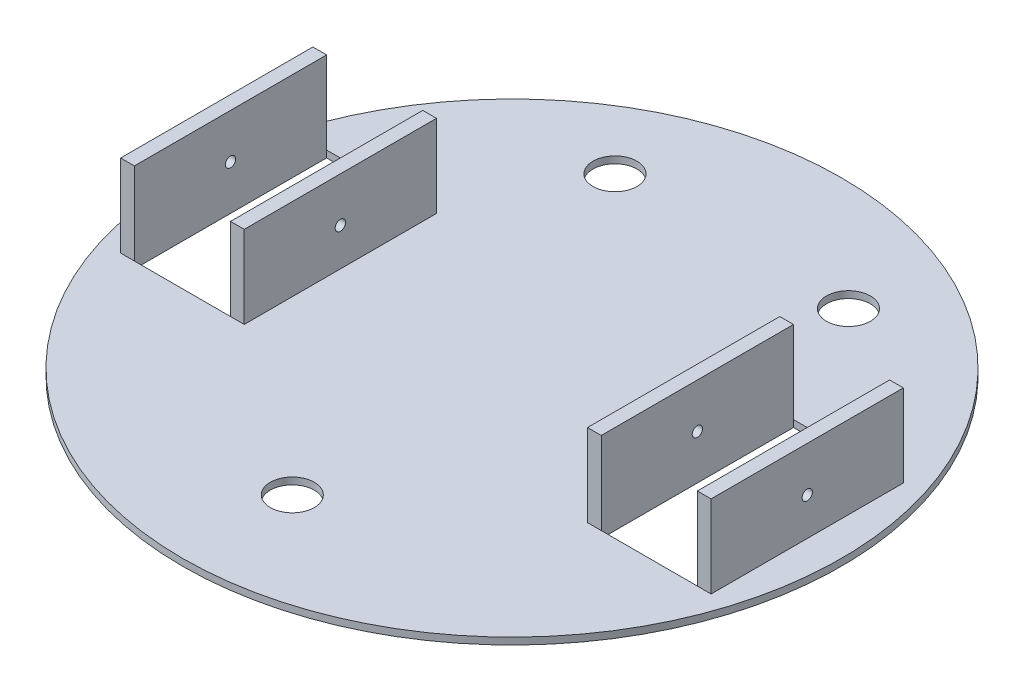
ISO-10303-21;
HEADER;
FILE_DESCRIPTION(('STEP AP214'),'2;1');
FILE_NAME('part.step','',(''),(''),'','','');
FILE_SCHEMA(('AUTOMOTIVE_DESIGN { 1 0 10303 214 1 1 1 1 }'));
ENDSEC;
DATA;
#1=APPLICATION_CONTEXT('core data for automotive mechanical design processes');
#2=APPLICATION_PROTOCOL_DEFINITION('international standard','automotive_design',2000,#1);
#3=PRODUCT_CONTEXT('',#1,'mechanical');
#4=PRODUCT('Part','Part','',(#3));
#5=PRODUCT_RELATED_PRODUCT_CATEGORY('part','',(#4));
#6=PRODUCT_DEFINITION_FORMATION('','',#4);
#7=PRODUCT_DEFINITION_CONTEXT('part definition',#1,'design');
#8=PRODUCT_DEFINITION('design','',#6,#7);
#9=PRODUCT_DEFINITION_SHAPE('','',#8);
#10=(LENGTH_UNIT() NAMED_UNIT(*) SI_UNIT(.MILLI.,.METRE.));
#11=(NAMED_UNIT(*) PLANE_ANGLE_UNIT() SI_UNIT($,.RADIAN.));
#12=(NAMED_UNIT(*) SI_UNIT($,.STERADIAN.) SOLID_ANGLE_UNIT());
#13=UNCERTAINTY_MEASURE_WITH_UNIT(LENGTH_MEASURE(1.E-05),#10,'distance_accuracy_value','');
#14=(GEOMETRIC_REPRESENTATION_CONTEXT(3) GLOBAL_UNCERTAINTY_ASSIGNED_CONTEXT((#13)) GLOBAL_UNIT_ASSIGNED_CONTEXT((#10,
#11,#12)) REPRESENTATION_CONTEXT('',''));
#15=CARTESIAN_POINT('',(0.,0.,0.));
#16=DIRECTION('',(0.,0.,1.));
#17=DIRECTION('',(1.,0.,0.));
#18=AXIS2_PLACEMENT_3D('',#15,#16,#17);
#19=CARTESIAN_POINT('',(0.,3.175,0.));
#20=DIRECTION('',(0.,1.,0.));
#21=DIRECTION('',(0.,0.,1.));
#22=AXIS2_PLACEMENT_3D('',#19,#20,#21);
#23=PLANE('',#22);
#24=CARTESIAN_POINT('',(53.975,3.175,-101.6));
#25=DIRECTION('',(0.,1.,0.));
#26=DIRECTION('',(0.,0.,1.));
#27=AXIS2_PLACEMENT_3D('',#24,#25,#26);
#28=CIRCLE('',#27,10.16);
#29=CARTESIAN_POINT('',(53.975,3.175,-91.44));
#30=VERTEX_POINT('',#29);
#31=EDGE_CURVE('E501',#30,#30,#28,.T.);
#32=ORIENTED_EDGE('',*,*,#31,.F.);
#33=EDGE_LOOP('',(#32));
#34=FACE_BOUND('',#33,.T.);
#35=CARTESIAN_POINT('',(-53.975,3.175,-101.6));
#36=DIRECTION('',(0.,1.,0.));
#37=DIRECTION('',(0.,0.,1.));
#38=AXIS2_PLACEMENT_3D('',#35,#36,#37);
#39=CIRCLE('',#38,10.16);
#40=CARTESIAN_POINT('',(-53.975,3.175,-91.44));
#41=VERTEX_POINT('',#40);
#42=EDGE_CURVE('E503',#41,#41,#39,.T.);
#43=ORIENTED_EDGE('',*,*,#42,.F.);
#44=EDGE_LOOP('',(#43));
#45=FACE_BOUND('',#44,.T.);
#46=CARTESIAN_POINT('',(0.,3.175,101.6));
#47=DIRECTION('',(0.,1.,0.));
#48=DIRECTION('',(0.,0.,1.));
#49=AXIS2_PLACEMENT_3D('',#46,#47,#48);
#50=CIRCLE('',#49,10.16);
#51=CARTESIAN_POINT('',(0.,3.175,111.76));
#52=VERTEX_POINT('',#51);
#53=EDGE_CURVE('E509',#52,#52,#50,.T.);
#54=ORIENTED_EDGE('',*,*,#53,.F.);
#55=EDGE_LOOP('',(#54));
#56=FACE_BOUND('',#55,.T.);
#57=DIRECTION('',(1.,0.,0.));
#58=VECTOR('',#57,1.);
#59=CARTESIAN_POINT('',(85.725,3.175,-44.45));
#60=LINE('',#59,#58);
#61=CARTESIAN_POINT('',(79.375,3.175,-44.45));
#62=VERTEX_POINT('',#61);
#63=CARTESIAN_POINT('',(85.725,3.175,-44.45));
#64=VERTEX_POINT('',#63);
#65=EDGE_CURVE('E205',#62,#64,#60,.T.);
#66=ORIENTED_EDGE('',*,*,#65,.T.);
#67=DIRECTION('',(1.,0.,0.));
#68=VECTOR('',#67,1.);
#69=CARTESIAN_POINT('',(85.725,3.175,-44.45));
#70=LINE('',#69,#68);
#71=CARTESIAN_POINT('',(130.175,3.175,-44.45));
#72=VERTEX_POINT('',#71);
#73=EDGE_CURVE('E248',#64,#72,#70,.T.);
#74=ORIENTED_EDGE('',*,*,#73,.T.);
#75=DIRECTION('',(1.,0.,0.));
#76=VECTOR('',#75,1.);
#77=CARTESIAN_POINT('',(130.175,3.175,-44.45));
#78=LINE('',#77,#76);
#79=CARTESIAN_POINT('',(136.525,3.175,-44.45));
#80=VERTEX_POINT('',#79);
#81=EDGE_CURVE('E218',#72,#80,#78,.T.);
#82=ORIENTED_EDGE('',*,*,#81,.T.);
#83=DIRECTION('',(0.,0.,1.));
#84=VECTOR('',#83,1.);
#85=CARTESIAN_POINT('',(136.525,3.175,-44.45));
#86=LINE('',#85,#84);
#87=CARTESIAN_POINT('',(136.525,3.175,44.45));
#88=VERTEX_POINT('',#87);
#89=EDGE_CURVE('E230',#80,#88,#86,.T.);
#90=ORIENTED_EDGE('',*,*,#89,.T.);
#91=DIRECTION('',(-1.,0.,0.));
#92=VECTOR('',#91,1.);
#93=CARTESIAN_POINT('',(130.175,3.175,44.45));
#94=LINE('',#93,#92);
#95=CARTESIAN_POINT('',(130.175,3.175,44.45));
#96=VERTEX_POINT('',#95);
#97=EDGE_CURVE('E185',#88,#96,#94,.T.);
#98=ORIENTED_EDGE('',*,*,#97,.T.);
#99=DIRECTION('',(-1.,0.,0.));
#100=VECTOR('',#99,1.);
#101=CARTESIAN_POINT('',(85.725,3.175,44.45));
#102=LINE('',#101,#100);
#103=CARTESIAN_POINT('',(85.725,3.175,44.45));
#104=VERTEX_POINT('',#103);
#105=EDGE_CURVE('E244',#96,#104,#102,.T.);
#106=ORIENTED_EDGE('',*,*,#105,.T.);
#107=DIRECTION('',(-1.,0.,0.));
#108=VECTOR('',#107,1.);
#109=CARTESIAN_POINT('',(85.725,3.175,44.45));
#110=LINE('',#109,#108);
#111=CARTESIAN_POINT('',(79.375,3.175,44.45));
#112=VERTEX_POINT('',#111);
#113=EDGE_CURVE('E55',#104,#112,#110,.T.);
#114=ORIENTED_EDGE('',*,*,#113,.T.);
#115=DIRECTION('',(0.,0.,-1.));
#116=VECTOR('',#115,1.);
#117=CARTESIAN_POINT('',(79.375,3.175,-44.45));
#118=LINE('',#117,#116);
#119=EDGE_CURVE('E50',#112,#62,#118,.T.);
#120=ORIENTED_EDGE('',*,*,#119,.T.);
#121=EDGE_LOOP('',(#66,#74,#82,#90,#98,#106,#114,#120));
#122=FACE_BOUND('',#121,.T.);
#123=DIRECTION('',(0.,0.,-1.));
#124=VECTOR('',#123,1.);
#125=CARTESIAN_POINT('',(-79.375,3.175,-44.45));
#126=LINE('',#125,#124);
#127=CARTESIAN_POINT('',(-79.375,3.175,44.45));
#128=VERTEX_POINT('',#127);
#129=CARTESIAN_POINT('',(-79.375,3.175,-44.45));
#130=VERTEX_POINT('',#129);
#131=EDGE_CURVE('E279',#128,#130,#126,.T.);
#132=ORIENTED_EDGE('',*,*,#131,.F.);
#133=DIRECTION('',(1.,0.,0.));
#134=VECTOR('',#133,1.);
#135=CARTESIAN_POINT('',(-85.725,3.175,44.45));
#136=LINE('',#135,#134);
#137=CARTESIAN_POINT('',(-85.725,3.175,44.45));
#138=VERTEX_POINT('',#137);
#139=EDGE_CURVE('E260',#138,#128,#136,.T.);
#140=ORIENTED_EDGE('',*,*,#139,.F.);
#141=DIRECTION('',(1.,0.,0.));
#142=VECTOR('',#141,1.);
#143=CARTESIAN_POINT('',(-85.725,3.175,44.45));
#144=LINE('',#143,#142);
#145=CARTESIAN_POINT('',(-130.175,3.175,44.45));
#146=VERTEX_POINT('',#145);
#147=EDGE_CURVE('E327',#146,#138,#144,.T.);
#148=ORIENTED_EDGE('',*,*,#147,.F.);
#149=DIRECTION('',(1.,0.,0.));
#150=VECTOR('',#149,1.);
#151=CARTESIAN_POINT('',(-130.175,3.175,44.45));
#152=LINE('',#151,#150);
#153=CARTESIAN_POINT('',(-136.525,3.175,44.45));
#154=VERTEX_POINT('',#153);
#155=EDGE_CURVE('E297',#154,#146,#152,.T.);
#156=ORIENTED_EDGE('',*,*,#155,.F.);
#157=DIRECTION('',(0.,0.,1.));
#158=VECTOR('',#157,1.);
#159=CARTESIAN_POINT('',(-136.525,3.175,-44.45));
#160=LINE('',#159,#158);
#161=CARTESIAN_POINT('',(-136.525,3.175,-44.45));
#162=VERTEX_POINT('',#161);
#163=EDGE_CURVE('E306',#162,#154,#160,.T.);
#164=ORIENTED_EDGE('',*,*,#163,.F.);
#165=DIRECTION('',(-1.,0.,0.));
#166=VECTOR('',#165,1.);
#167=CARTESIAN_POINT('',(-130.175,3.175,-44.45));
#168=LINE('',#167,#166);
#169=CARTESIAN_POINT('',(-130.175,3.175,-44.45));
#170=VERTEX_POINT('',#169);
#171=EDGE_CURVE('E292',#170,#162,#168,.T.);
#172=ORIENTED_EDGE('',*,*,#171,.F.);
#173=DIRECTION('',(-1.,0.,0.));
#174=VECTOR('',#173,1.);
#175=CARTESIAN_POINT('',(-85.725,3.175,-44.45));
#176=LINE('',#175,#174);
#177=CARTESIAN_POINT('',(-85.725,3.175,-44.45));
#178=VERTEX_POINT('',#177);
#179=EDGE_CURVE('E322',#178,#170,#176,.T.);
#180=ORIENTED_EDGE('',*,*,#179,.F.);
#181=DIRECTION('',(-1.,0.,0.));
#182=VECTOR('',#181,1.);
#183=CARTESIAN_POINT('',(-85.725,3.175,-44.45));
#184=LINE('',#183,#182);
#185=EDGE_CURVE('E271',#130,#178,#184,.T.);
#186=ORIENTED_EDGE('',*,*,#185,.F.);
#187=EDGE_LOOP('',(#132,#140,#148,#156,#164,#172,#180,#186));
#188=FACE_BOUND('',#187,.T.);
#189=CARTESIAN_POINT('',(0.,3.175,0.));
#190=DIRECTION('',(0.,1.,0.));
#191=DIRECTION('',(0.,0.,1.));
#192=AXIS2_PLACEMENT_3D('',#189,#190,#191);
#193=CIRCLE('',#192,152.4);
#194=CARTESIAN_POINT('',(0.,3.175,152.4));
#195=VERTEX_POINT('',#194);
#196=EDGE_CURVE('E11',#195,#195,#193,.T.);
#197=ORIENTED_EDGE('',*,*,#196,.T.);
#198=EDGE_LOOP('',(#197));
#199=FACE_BOUND('',#198,.T.);
#200=ADVANCED_FACE('F33',(#34,#45,#56,#122,#188,#199),#23,.T.);
#201=CARTESIAN_POINT('',(0.,0.,0.));
#202=DIRECTION('',(0.,1.,0.));
#203=DIRECTION('',(0.,0.,1.));
#204=AXIS2_PLACEMENT_3D('',#201,#202,#203);
#205=PLANE('',#204);
#206=CARTESIAN_POINT('',(53.975,0.,-101.6));
#207=DIRECTION('',(0.,1.,0.));
#208=DIRECTION('',(0.,0.,1.));
#209=AXIS2_PLACEMENT_3D('',#206,#207,#208);
#210=CIRCLE('',#209,10.16);
#211=CARTESIAN_POINT('',(53.975,0.,-91.44));
#212=VERTEX_POINT('',#211);
#213=EDGE_CURVE('E498',#212,#212,#210,.T.);
#214=ORIENTED_EDGE('',*,*,#213,.T.);
#215=EDGE_LOOP('',(#214));
#216=FACE_BOUND('',#215,.T.);
#217=CARTESIAN_POINT('',(-53.975,0.,-101.6));
#218=DIRECTION('',(0.,1.,0.));
#219=DIRECTION('',(0.,0.,1.));
#220=AXIS2_PLACEMENT_3D('',#217,#218,#219);
#221=CIRCLE('',#220,10.16);
#222=CARTESIAN_POINT('',(-53.975,0.,-91.44));
#223=VERTEX_POINT('',#222);
#224=EDGE_CURVE('E506',#223,#223,#221,.T.);
#225=ORIENTED_EDGE('',*,*,#224,.T.);
#226=EDGE_LOOP('',(#225));
#227=FACE_BOUND('',#226,.T.);
#228=CARTESIAN_POINT('',(0.,0.,101.6));
#229=DIRECTION('',(0.,1.,0.));
#230=DIRECTION('',(0.,0.,1.));
#231=AXIS2_PLACEMENT_3D('',#228,#229,#230);
#232=CIRCLE('',#231,10.16);
#233=CARTESIAN_POINT('',(0.,0.,111.76));
#234=VERTEX_POINT('',#233);
#235=EDGE_CURVE('E512',#234,#234,#232,.T.);
#236=ORIENTED_EDGE('',*,*,#235,.T.);
#237=EDGE_LOOP('',(#236));
#238=FACE_BOUND('',#237,.T.);
#239=CARTESIAN_POINT('',(0.,0.,0.));
#240=DIRECTION('',(0.,1.,0.));
#241=DIRECTION('',(0.,0.,1.));
#242=AXIS2_PLACEMENT_3D('',#239,#240,#241);
#243=CIRCLE('',#242,152.4);
#244=CARTESIAN_POINT('',(0.,0.,152.4));
#245=VERTEX_POINT('',#244);
#246=EDGE_CURVE('E42',#245,#245,#243,.T.);
#247=ORIENTED_EDGE('',*,*,#246,.F.);
#248=EDGE_LOOP('',(#247));
#249=FACE_BOUND('',#248,.T.);
#250=DIRECTION('',(1.,0.,0.));
#251=VECTOR('',#250,1.);
#252=CARTESIAN_POINT('',(-85.725,0.,44.45));
#253=LINE('',#252,#251);
#254=CARTESIAN_POINT('',(-130.175,0.,44.45));
#255=VERTEX_POINT('',#254);
#256=CARTESIAN_POINT('',(-85.725,0.,44.45));
#257=VERTEX_POINT('',#256);
#258=EDGE_CURVE('E333',#255,#257,#253,.T.);
#259=ORIENTED_EDGE('',*,*,#258,.T.);
#260=DIRECTION('',(0.,0.,-1.));
#261=VECTOR('',#260,1.);
#262=CARTESIAN_POINT('',(-85.725,0.,-44.45));
#263=LINE('',#262,#261);
#264=CARTESIAN_POINT('',(-85.725,0.,-44.45));
#265=VERTEX_POINT('',#264);
#266=EDGE_CURVE('E323',#257,#265,#263,.T.);
#267=ORIENTED_EDGE('',*,*,#266,.T.);
#268=DIRECTION('',(-1.,0.,0.));
#269=VECTOR('',#268,1.);
#270=CARTESIAN_POINT('',(-85.725,0.,-44.45));
#271=LINE('',#270,#269);
#272=CARTESIAN_POINT('',(-130.175,0.,-44.45));
#273=VERTEX_POINT('',#272);
#274=EDGE_CURVE('E326',#265,#273,#271,.T.);
#275=ORIENTED_EDGE('',*,*,#274,.T.);
#276=DIRECTION('',(0.,0.,1.));
#277=VECTOR('',#276,1.);
#278=CARTESIAN_POINT('',(-130.175,0.,-44.45));
#279=LINE('',#278,#277);
#280=EDGE_CURVE('E330',#273,#255,#279,.T.);
#281=ORIENTED_EDGE('',*,*,#280,.T.);
#282=EDGE_LOOP('',(#259,#267,#275,#281));
#283=FACE_BOUND('',#282,.T.);
#284=DIRECTION('',(0.,0.,-1.));
#285=VECTOR('',#284,1.);
#286=CARTESIAN_POINT('',(85.725,0.,-44.45));
#287=LINE('',#286,#285);
#288=CARTESIAN_POINT('',(85.725,0.,44.45));
#289=VERTEX_POINT('',#288);
#290=CARTESIAN_POINT('',(85.725,0.,-44.45));
#291=VERTEX_POINT('',#290);
#292=EDGE_CURVE('E245',#289,#291,#287,.T.);
#293=ORIENTED_EDGE('',*,*,#292,.F.);
#294=DIRECTION('',(-1.,0.,0.));
#295=VECTOR('',#294,1.);
#296=CARTESIAN_POINT('',(85.725,0.,44.45));
#297=LINE('',#296,#295);
#298=CARTESIAN_POINT('',(130.175,0.,44.45));
#299=VERTEX_POINT('',#298);
#300=EDGE_CURVE('E247',#299,#289,#297,.T.);
#301=ORIENTED_EDGE('',*,*,#300,.F.);
#302=DIRECTION('',(0.,0.,1.));
#303=VECTOR('',#302,1.);
#304=CARTESIAN_POINT('',(130.175,0.,-44.45));
#305=LINE('',#304,#303);
#306=CARTESIAN_POINT('',(130.175,0.,-44.45));
#307=VERTEX_POINT('',#306);
#308=EDGE_CURVE('E250',#307,#299,#305,.T.);
#309=ORIENTED_EDGE('',*,*,#308,.F.);
#310=DIRECTION('',(1.,0.,0.));
#311=VECTOR('',#310,1.);
#312=CARTESIAN_POINT('',(85.725,0.,-44.45));
#313=LINE('',#312,#311);
#314=EDGE_CURVE('E253',#291,#307,#313,.T.);
#315=ORIENTED_EDGE('',*,*,#314,.F.);
#316=EDGE_LOOP('',(#293,#301,#309,#315));
#317=FACE_BOUND('',#316,.T.);
#318=ADVANCED_FACE('F354',(#216,#227,#238,#249,#283,#317),#205,.F.);
#319=CARTESIAN_POINT('',(0.,3.175,0.));
#320=DIRECTION('',(0.,-1.,0.));
#321=DIRECTION('',(0.,0.,-1.));
#322=AXIS2_PLACEMENT_3D('',#319,#320,#321);
#323=CYLINDRICAL_SURFACE('',#322,152.4);
#324=ORIENTED_EDGE('',*,*,#196,.F.);
#325=EDGE_LOOP('',(#324));
#326=FACE_BOUND('',#325,.T.);
#327=ORIENTED_EDGE('',*,*,#246,.T.);
#328=EDGE_LOOP('',(#327));
#329=FACE_BOUND('',#328,.T.);
#330=ADVANCED_FACE('F35',(#326,#329),#323,.T.);
#331=CARTESIAN_POINT('',(-85.725,0.,-44.45));
#332=DIRECTION('',(1.,0.,0.));
#333=DIRECTION('',(0.,0.,-1.));
#334=AXIS2_PLACEMENT_3D('',#331,#332,#333);
#335=PLANE('',#334);
#336=CARTESIAN_POINT('',(-85.725,20.6375,0.));
#337=DIRECTION('',(1.,0.,0.));
#338=DIRECTION('',(0.,0.,-1.));
#339=AXIS2_PLACEMENT_3D('',#336,#337,#338);
#340=CIRCLE('',#339,2.38125);
#341=CARTESIAN_POINT('',(-85.725,20.6375,-2.38125000000003));
#342=VERTEX_POINT('',#341);
#343=EDGE_CURVE('E207',#342,#342,#340,.T.);
#344=ORIENTED_EDGE('',*,*,#343,.T.);
#345=EDGE_LOOP('',(#344));
#346=FACE_BOUND('',#345,.T.);
#347=DIRECTION('',(0.,1.,0.));
#348=VECTOR('',#347,1.);
#349=CARTESIAN_POINT('',(-85.725,0.,44.45));
#350=LINE('',#349,#348);
#351=EDGE_CURVE('E341',#257,#138,#350,.T.);
#352=ORIENTED_EDGE('',*,*,#351,.T.);
#353=DIRECTION('',(0.,-1.,0.));
#354=VECTOR('',#353,1.);
#355=CARTESIAN_POINT('',(-85.725,41.275,44.45));
#356=LINE('',#355,#354);
#357=CARTESIAN_POINT('',(-85.725,41.275,44.45));
#358=VERTEX_POINT('',#357);
#359=EDGE_CURVE('E290',#358,#138,#356,.T.);
#360=ORIENTED_EDGE('',*,*,#359,.F.);
#361=DIRECTION('',(0.,0.,1.));
#362=VECTOR('',#361,1.);
#363=CARTESIAN_POINT('',(-85.725,41.275,-44.45));
#364=LINE('',#363,#362);
#365=CARTESIAN_POINT('',(-85.725,41.275,-44.45));
#366=VERTEX_POINT('',#365);
#367=EDGE_CURVE('E267',#366,#358,#364,.T.);
#368=ORIENTED_EDGE('',*,*,#367,.F.);
#369=DIRECTION('',(0.,-1.,0.));
#370=VECTOR('',#369,1.);
#371=CARTESIAN_POINT('',(-85.725,41.275,-44.45));
#372=LINE('',#371,#370);
#373=EDGE_CURVE('E277',#366,#178,#372,.T.);
#374=ORIENTED_EDGE('',*,*,#373,.T.);
#375=DIRECTION('',(0.,1.,0.));
#376=VECTOR('',#375,1.);
#377=CARTESIAN_POINT('',(-85.725,0.,-44.45));
#378=LINE('',#377,#376);
#379=EDGE_CURVE('E336',#265,#178,#378,.T.);
#380=ORIENTED_EDGE('',*,*,#379,.F.);
#381=ORIENTED_EDGE('',*,*,#266,.F.);
#382=EDGE_LOOP('',(#352,#360,#368,#374,#380,#381));
#383=FACE_BOUND('',#382,.T.);
#384=ADVANCED_FACE('F379',(#346,#383),#335,.F.);
#385=CARTESIAN_POINT('',(-85.725,0.,44.45));
#386=DIRECTION('',(0.,0.,1.));
#387=DIRECTION('',(1.,0.,0.));
#388=AXIS2_PLACEMENT_3D('',#385,#386,#387);
#389=PLANE('',#388);
#390=ORIENTED_EDGE('',*,*,#147,.T.);
#391=ORIENTED_EDGE('',*,*,#351,.F.);
#392=ORIENTED_EDGE('',*,*,#258,.F.);
#393=DIRECTION('',(0.,1.,0.));
#394=VECTOR('',#393,1.);
#395=CARTESIAN_POINT('',(-130.175,0.,44.45));
#396=LINE('',#395,#394);
#397=EDGE_CURVE('E344',#255,#146,#396,.T.);
#398=ORIENTED_EDGE('',*,*,#397,.T.);
#399=EDGE_LOOP('',(#390,#391,#392,#398));
#400=FACE_BOUND('',#399,.T.);
#401=ADVANCED_FACE('F383',(#400),#389,.F.);
#402=CARTESIAN_POINT('',(-130.175,0.,-44.45));
#403=DIRECTION('',(-1.,0.,0.));
#404=DIRECTION('',(0.,0.,1.));
#405=AXIS2_PLACEMENT_3D('',#402,#403,#404);
#406=PLANE('',#405);
#407=CARTESIAN_POINT('',(-130.175,20.6375,0.));
#408=DIRECTION('',(-1.,0.,0.));
#409=DIRECTION('',(0.,0.,1.));
#410=AXIS2_PLACEMENT_3D('',#407,#408,#409);
#411=CIRCLE('',#410,2.38125);
#412=CARTESIAN_POINT('',(-130.175,20.6375,2.38124999999996));
#413=VERTEX_POINT('',#412);
#414=EDGE_CURVE('E532',#413,#413,#411,.T.);
#415=ORIENTED_EDGE('',*,*,#414,.T.);
#416=EDGE_LOOP('',(#415));
#417=FACE_BOUND('',#416,.T.);
#418=DIRECTION('',(0.,1.,0.));
#419=VECTOR('',#418,1.);
#420=CARTESIAN_POINT('',(-130.175,0.,-44.45));
#421=LINE('',#420,#419);
#422=EDGE_CURVE('E346',#273,#170,#421,.T.);
#423=ORIENTED_EDGE('',*,*,#422,.T.);
#424=DIRECTION('',(0.,-1.,0.));
#425=VECTOR('',#424,1.);
#426=CARTESIAN_POINT('',(-130.175,41.275,-44.45));
#427=LINE('',#426,#425);
#428=CARTESIAN_POINT('',(-130.175,41.275,-44.45));
#429=VERTEX_POINT('',#428);
#430=EDGE_CURVE('E319',#429,#170,#427,.T.);
#431=ORIENTED_EDGE('',*,*,#430,.F.);
#432=DIRECTION('',(0.,0.,-1.));
#433=VECTOR('',#432,1.);
#434=CARTESIAN_POINT('',(-130.175,41.275,-44.45));
#435=LINE('',#434,#433);
#436=CARTESIAN_POINT('',(-130.175,41.275,44.45));
#437=VERTEX_POINT('',#436);
#438=EDGE_CURVE('E293',#437,#429,#435,.T.);
#439=ORIENTED_EDGE('',*,*,#438,.F.);
#440=DIRECTION('',(0.,-1.,0.));
#441=VECTOR('',#440,1.);
#442=CARTESIAN_POINT('',(-130.175,41.275,44.45));
#443=LINE('',#442,#441);
#444=EDGE_CURVE('E303',#437,#146,#443,.T.);
#445=ORIENTED_EDGE('',*,*,#444,.T.);
#446=ORIENTED_EDGE('',*,*,#397,.F.);
#447=ORIENTED_EDGE('',*,*,#280,.F.);
#448=EDGE_LOOP('',(#423,#431,#439,#445,#446,#447));
#449=FACE_BOUND('',#448,.T.);
#450=ADVANCED_FACE('F389',(#417,#449),#406,.F.);
#451=CARTESIAN_POINT('',(-85.725,0.,-44.45));
#452=DIRECTION('',(0.,0.,-1.));
#453=DIRECTION('',(-1.,0.,0.));
#454=AXIS2_PLACEMENT_3D('',#451,#452,#453);
#455=PLANE('',#454);
#456=ORIENTED_EDGE('',*,*,#179,.T.);
#457=ORIENTED_EDGE('',*,*,#422,.F.);
#458=ORIENTED_EDGE('',*,*,#274,.F.);
#459=ORIENTED_EDGE('',*,*,#379,.T.);
#460=EDGE_LOOP('',(#456,#457,#458,#459));
#461=FACE_BOUND('',#460,.T.);
#462=ADVANCED_FACE('F395',(#461),#455,.F.);
#463=CARTESIAN_POINT('',(-130.175,41.275,-44.45));
#464=DIRECTION('',(0.,0.,1.));
#465=DIRECTION('',(1.,0.,0.));
#466=AXIS2_PLACEMENT_3D('',#463,#464,#465);
#467=PLANE('',#466);
#468=ORIENTED_EDGE('',*,*,#171,.T.);
#469=DIRECTION('',(0.,-1.,0.));
#470=VECTOR('',#469,1.);
#471=CARTESIAN_POINT('',(-136.525,41.275,-44.45));
#472=LINE('',#471,#470);
#473=CARTESIAN_POINT('',(-136.525,41.275,-44.45));
#474=VERTEX_POINT('',#473);
#475=EDGE_CURVE('E316',#474,#162,#472,.T.);
#476=ORIENTED_EDGE('',*,*,#475,.F.);
#477=DIRECTION('',(-1.,0.,0.));
#478=VECTOR('',#477,1.);
#479=CARTESIAN_POINT('',(-130.175,41.275,-44.45));
#480=LINE('',#479,#478);
#481=EDGE_CURVE('E296',#429,#474,#480,.T.);
#482=ORIENTED_EDGE('',*,*,#481,.F.);
#483=ORIENTED_EDGE('',*,*,#430,.T.);
#484=EDGE_LOOP('',(#468,#476,#482,#483));
#485=FACE_BOUND('',#484,.T.);
#486=ADVANCED_FACE('F398',(#485),#467,.F.);
#487=CARTESIAN_POINT('',(-136.525,41.275,-44.45));
#488=DIRECTION('',(1.,0.,0.));
#489=DIRECTION('',(0.,0.,-1.));
#490=AXIS2_PLACEMENT_3D('',#487,#488,#489);
#491=PLANE('',#490);
#492=CARTESIAN_POINT('',(-136.525,20.6375,0.));
#493=DIRECTION('',(1.,0.,0.));
#494=DIRECTION('',(0.,0.,-1.));
#495=AXIS2_PLACEMENT_3D('',#492,#493,#494);
#496=CIRCLE('',#495,2.38125);
#497=CARTESIAN_POINT('',(-136.525,20.6375,-2.38125000000004));
#498=VERTEX_POINT('',#497);
#499=EDGE_CURVE('E529',#498,#498,#496,.T.);
#500=ORIENTED_EDGE('',*,*,#499,.T.);
#501=EDGE_LOOP('',(#500));
#502=FACE_BOUND('',#501,.T.);
#503=ORIENTED_EDGE('',*,*,#163,.T.);
#504=DIRECTION('',(0.,-1.,0.));
#505=VECTOR('',#504,1.);
#506=CARTESIAN_POINT('',(-136.525,41.275,44.45));
#507=LINE('',#506,#505);
#508=CARTESIAN_POINT('',(-136.525,41.275,44.45));
#509=VERTEX_POINT('',#508);
#510=EDGE_CURVE('E313',#509,#154,#507,.T.);
#511=ORIENTED_EDGE('',*,*,#510,.F.);
#512=DIRECTION('',(0.,0.,1.));
#513=VECTOR('',#512,1.);
#514=CARTESIAN_POINT('',(-136.525,41.275,-44.45));
#515=LINE('',#514,#513);
#516=EDGE_CURVE('E299',#474,#509,#515,.T.);
#517=ORIENTED_EDGE('',*,*,#516,.F.);
#518=ORIENTED_EDGE('',*,*,#475,.T.);
#519=EDGE_LOOP('',(#503,#511,#517,#518));
#520=FACE_BOUND('',#519,.T.);
#521=ADVANCED_FACE('F405',(#502,#520),#491,.F.);
#522=CARTESIAN_POINT('',(-130.175,41.275,44.45));
#523=DIRECTION('',(0.,0.,-1.));
#524=DIRECTION('',(-1.,0.,0.));
#525=AXIS2_PLACEMENT_3D('',#522,#523,#524);
#526=PLANE('',#525);
#527=ORIENTED_EDGE('',*,*,#155,.T.);
#528=ORIENTED_EDGE('',*,*,#444,.F.);
#529=DIRECTION('',(1.,0.,0.));
#530=VECTOR('',#529,1.);
#531=CARTESIAN_POINT('',(-130.175,41.275,44.45));
#532=LINE('',#531,#530);
#533=EDGE_CURVE('E301',#509,#437,#532,.T.);
#534=ORIENTED_EDGE('',*,*,#533,.F.);
#535=ORIENTED_EDGE('',*,*,#510,.T.);
#536=EDGE_LOOP('',(#527,#528,#534,#535));
#537=FACE_BOUND('',#536,.T.);
#538=ADVANCED_FACE('F409',(#537),#526,.F.);
#539=CARTESIAN_POINT('',(-130.175,41.275,44.45));
#540=DIRECTION('',(0.,-1.,0.));
#541=DIRECTION('',(0.,0.,-1.));
#542=AXIS2_PLACEMENT_3D('',#539,#540,#541);
#543=PLANE('',#542);
#544=ORIENTED_EDGE('',*,*,#438,.T.);
#545=ORIENTED_EDGE('',*,*,#481,.T.);
#546=ORIENTED_EDGE('',*,*,#516,.T.);
#547=ORIENTED_EDGE('',*,*,#533,.T.);
#548=EDGE_LOOP('',(#544,#545,#546,#547));
#549=FACE_BOUND('',#548,.T.);
#550=ADVANCED_FACE('F413',(#549),#543,.F.);
#551=CARTESIAN_POINT('',(-85.725,41.275,44.45));
#552=DIRECTION('',(0.,0.,-1.));
#553=DIRECTION('',(-1.,0.,0.));
#554=AXIS2_PLACEMENT_3D('',#551,#552,#553);
#555=PLANE('',#554);
#556=ORIENTED_EDGE('',*,*,#139,.T.);
#557=DIRECTION('',(0.,-1.,0.));
#558=VECTOR('',#557,1.);
#559=CARTESIAN_POINT('',(-79.375,41.275,44.45));
#560=LINE('',#559,#558);
#561=CARTESIAN_POINT('',(-79.375,41.275,44.45));
#562=VERTEX_POINT('',#561);
#563=EDGE_CURVE('E287',#562,#128,#560,.T.);
#564=ORIENTED_EDGE('',*,*,#563,.F.);
#565=DIRECTION('',(1.,0.,0.));
#566=VECTOR('',#565,1.);
#567=CARTESIAN_POINT('',(-85.725,41.275,44.45));
#568=LINE('',#567,#566);
#569=EDGE_CURVE('E270',#358,#562,#568,.T.);
#570=ORIENTED_EDGE('',*,*,#569,.F.);
#571=ORIENTED_EDGE('',*,*,#359,.T.);
#572=EDGE_LOOP('',(#556,#564,#570,#571));
#573=FACE_BOUND('',#572,.T.);
#574=ADVANCED_FACE('F417',(#573),#555,.F.);
#575=CARTESIAN_POINT('',(-79.375,41.275,-44.45));
#576=DIRECTION('',(-1.,0.,0.));
#577=DIRECTION('',(0.,0.,1.));
#578=AXIS2_PLACEMENT_3D('',#575,#576,#577);
#579=PLANE('',#578);
#580=CARTESIAN_POINT('',(-79.375,20.6375,0.));
#581=DIRECTION('',(-1.,0.,0.));
#582=DIRECTION('',(0.,0.,1.));
#583=AXIS2_PLACEMENT_3D('',#580,#581,#582);
#584=CIRCLE('',#583,2.38125);
#585=CARTESIAN_POINT('',(-79.375,20.6375,2.38124999999997));
#586=VERTEX_POINT('',#585);
#587=EDGE_CURVE('E526',#586,#586,#584,.T.);
#588=ORIENTED_EDGE('',*,*,#587,.T.);
#589=EDGE_LOOP('',(#588));
#590=FACE_BOUND('',#589,.T.);
#591=ORIENTED_EDGE('',*,*,#131,.T.);
#592=DIRECTION('',(0.,-1.,0.));
#593=VECTOR('',#592,1.);
#594=CARTESIAN_POINT('',(-79.375,41.275,-44.45));
#595=LINE('',#594,#593);
#596=CARTESIAN_POINT('',(-79.375,41.275,-44.45));
#597=VERTEX_POINT('',#596);
#598=EDGE_CURVE('E284',#597,#130,#595,.T.);
#599=ORIENTED_EDGE('',*,*,#598,.F.);
#600=DIRECTION('',(0.,0.,-1.));
#601=VECTOR('',#600,1.);
#602=CARTESIAN_POINT('',(-79.375,41.275,-44.45));
#603=LINE('',#602,#601);
#604=EDGE_CURVE('E273',#562,#597,#603,.T.);
#605=ORIENTED_EDGE('',*,*,#604,.F.);
#606=ORIENTED_EDGE('',*,*,#563,.T.);
#607=EDGE_LOOP('',(#591,#599,#605,#606));
#608=FACE_BOUND('',#607,.T.);
#609=ADVANCED_FACE('F421',(#590,#608),#579,.F.);
#610=CARTESIAN_POINT('',(-85.725,41.275,-44.45));
#611=DIRECTION('',(0.,0.,1.));
#612=DIRECTION('',(1.,0.,0.));
#613=AXIS2_PLACEMENT_3D('',#610,#611,#612);
#614=PLANE('',#613);
#615=ORIENTED_EDGE('',*,*,#185,.T.);
#616=ORIENTED_EDGE('',*,*,#373,.F.);
#617=DIRECTION('',(-1.,0.,0.));
#618=VECTOR('',#617,1.);
#619=CARTESIAN_POINT('',(-85.725,41.275,-44.45));
#620=LINE('',#619,#618);
#621=EDGE_CURVE('E275',#597,#366,#620,.T.);
#622=ORIENTED_EDGE('',*,*,#621,.F.);
#623=ORIENTED_EDGE('',*,*,#598,.T.);
#624=EDGE_LOOP('',(#615,#616,#622,#623));
#625=FACE_BOUND('',#624,.T.);
#626=ADVANCED_FACE('F425',(#625),#614,.F.);
#627=CARTESIAN_POINT('',(-85.725,41.275,44.45));
#628=DIRECTION('',(0.,1.,0.));
#629=DIRECTION('',(0.,0.,1.));
#630=AXIS2_PLACEMENT_3D('',#627,#628,#629);
#631=PLANE('',#630);
#632=ORIENTED_EDGE('',*,*,#367,.T.);
#633=ORIENTED_EDGE('',*,*,#569,.T.);
#634=ORIENTED_EDGE('',*,*,#604,.T.);
#635=ORIENTED_EDGE('',*,*,#621,.T.);
#636=EDGE_LOOP('',(#632,#633,#634,#635));
#637=FACE_BOUND('',#636,.T.);
#638=ADVANCED_FACE('F429',(#637),#631,.T.);
#639=CARTESIAN_POINT('',(85.725,0.,-44.45));
#640=DIRECTION('',(1.,0.,0.));
#641=DIRECTION('',(0.,0.,-1.));
#642=AXIS2_PLACEMENT_3D('',#639,#640,#641);
#643=PLANE('',#642);
#644=CARTESIAN_POINT('',(85.725,20.6375,0.));
#645=DIRECTION('',(1.,0.,0.));
#646=DIRECTION('',(0.,0.,-1.));
#647=AXIS2_PLACEMENT_3D('',#644,#645,#646);
#648=CIRCLE('',#647,2.38125);
#649=CARTESIAN_POINT('',(85.725,20.6375,-2.38125000000001));
#650=VERTEX_POINT('',#649);
#651=EDGE_CURVE('E523',#650,#650,#648,.T.);
#652=ORIENTED_EDGE('',*,*,#651,.F.);
#653=EDGE_LOOP('',(#652));
#654=FACE_BOUND('',#653,.T.);
#655=DIRECTION('',(0.,1.,0.));
#656=VECTOR('',#655,1.);
#657=CARTESIAN_POINT('',(85.725,0.,-44.45));
#658=LINE('',#657,#656);
#659=EDGE_CURVE('E180',#291,#64,#658,.T.);
#660=ORIENTED_EDGE('',*,*,#659,.T.);
#661=DIRECTION('',(0.,-1.,0.));
#662=VECTOR('',#661,1.);
#663=CARTESIAN_POINT('',(85.725,41.275,-44.45));
#664=LINE('',#663,#662);
#665=CARTESIAN_POINT('',(85.725,41.275,-44.45));
#666=VERTEX_POINT('',#665);
#667=EDGE_CURVE('E173',#666,#64,#664,.T.);
#668=ORIENTED_EDGE('',*,*,#667,.F.);
#669=DIRECTION('',(0.,0.,1.));
#670=VECTOR('',#669,1.);
#671=CARTESIAN_POINT('',(85.725,41.275,-44.45));
#672=LINE('',#671,#670);
#673=CARTESIAN_POINT('',(85.725,41.275,44.45));
#674=VERTEX_POINT('',#673);
#675=EDGE_CURVE('E177',#666,#674,#672,.T.);
#676=ORIENTED_EDGE('',*,*,#675,.T.);
#677=DIRECTION('',(0.,-1.,0.));
#678=VECTOR('',#677,1.);
#679=CARTESIAN_POINT('',(85.725,41.275,44.45));
#680=LINE('',#679,#678);
#681=EDGE_CURVE('E204',#674,#104,#680,.T.);
#682=ORIENTED_EDGE('',*,*,#681,.T.);
#683=DIRECTION('',(0.,1.,0.));
#684=VECTOR('',#683,1.);
#685=CARTESIAN_POINT('',(85.725,0.,44.45));
#686=LINE('',#685,#684);
#687=EDGE_CURVE('E255',#289,#104,#686,.T.);
#688=ORIENTED_EDGE('',*,*,#687,.F.);
#689=ORIENTED_EDGE('',*,*,#292,.T.);
#690=EDGE_LOOP('',(#660,#668,#676,#682,#688,#689));
#691=FACE_BOUND('',#690,.T.);
#692=ADVANCED_FACE('F175',(#654,#691),#643,.T.);
#693=CARTESIAN_POINT('',(85.725,0.,-44.45));
#694=DIRECTION('',(0.,0.,1.));
#695=DIRECTION('',(1.,0.,0.));
#696=AXIS2_PLACEMENT_3D('',#693,#694,#695);
#697=PLANE('',#696);
#698=ORIENTED_EDGE('',*,*,#73,.F.);
#699=ORIENTED_EDGE('',*,*,#659,.F.);
#700=ORIENTED_EDGE('',*,*,#314,.T.);
#701=DIRECTION('',(0.,1.,0.));
#702=VECTOR('',#701,1.);
#703=CARTESIAN_POINT('',(130.175,0.,-44.45));
#704=LINE('',#703,#702);
#705=EDGE_CURVE('E261',#307,#72,#704,.T.);
#706=ORIENTED_EDGE('',*,*,#705,.T.);
#707=EDGE_LOOP('',(#698,#699,#700,#706));
#708=FACE_BOUND('',#707,.T.);
#709=ADVANCED_FACE('F366',(#708),#697,.T.);
#710=CARTESIAN_POINT('',(130.175,0.,-44.45));
#711=DIRECTION('',(-1.,0.,0.));
#712=DIRECTION('',(0.,0.,1.));
#713=AXIS2_PLACEMENT_3D('',#710,#711,#712);
#714=PLANE('',#713);
#715=CARTESIAN_POINT('',(130.175,20.6375,0.));
#716=DIRECTION('',(-1.,0.,0.));
#717=DIRECTION('',(0.,0.,1.));
#718=AXIS2_PLACEMENT_3D('',#715,#716,#717);
#719=CIRCLE('',#718,2.38125);
#720=CARTESIAN_POINT('',(130.175,20.6375,2.38125));
#721=VERTEX_POINT('',#720);
#722=EDGE_CURVE('E520',#721,#721,#719,.T.);
#723=ORIENTED_EDGE('',*,*,#722,.F.);
#724=EDGE_LOOP('',(#723));
#725=FACE_BOUND('',#724,.T.);
#726=DIRECTION('',(0.,1.,0.));
#727=VECTOR('',#726,1.);
#728=CARTESIAN_POINT('',(130.175,0.,44.45));
#729=LINE('',#728,#727);
#730=EDGE_CURVE('E263',#299,#96,#729,.T.);
#731=ORIENTED_EDGE('',*,*,#730,.T.);
#732=DIRECTION('',(0.,-1.,0.));
#733=VECTOR('',#732,1.);
#734=CARTESIAN_POINT('',(130.175,41.275,44.45));
#735=LINE('',#734,#733);
#736=CARTESIAN_POINT('',(130.175,41.275,44.45));
#737=VERTEX_POINT('',#736);
#738=EDGE_CURVE('E241',#737,#96,#735,.T.);
#739=ORIENTED_EDGE('',*,*,#738,.F.);
#740=DIRECTION('',(0.,0.,-1.));
#741=VECTOR('',#740,1.);
#742=CARTESIAN_POINT('',(130.175,41.275,-44.45));
#743=LINE('',#742,#741);
#744=CARTESIAN_POINT('',(130.175,41.275,-44.45));
#745=VERTEX_POINT('',#744);
#746=EDGE_CURVE('E214',#737,#745,#743,.T.);
#747=ORIENTED_EDGE('',*,*,#746,.T.);
#748=DIRECTION('',(0.,-1.,0.));
#749=VECTOR('',#748,1.);
#750=CARTESIAN_POINT('',(130.175,41.275,-44.45));
#751=LINE('',#750,#749);
#752=EDGE_CURVE('E227',#745,#72,#751,.T.);
#753=ORIENTED_EDGE('',*,*,#752,.T.);
#754=ORIENTED_EDGE('',*,*,#705,.F.);
#755=ORIENTED_EDGE('',*,*,#308,.T.);
#756=EDGE_LOOP('',(#731,#739,#747,#753,#754,#755));
#757=FACE_BOUND('',#756,.T.);
#758=ADVANCED_FACE('F441',(#725,#757),#714,.T.);
#759=CARTESIAN_POINT('',(85.725,0.,44.45));
#760=DIRECTION('',(0.,0.,-1.));
#761=DIRECTION('',(-1.,0.,0.));
#762=AXIS2_PLACEMENT_3D('',#759,#760,#761);
#763=PLANE('',#762);
#764=ORIENTED_EDGE('',*,*,#105,.F.);
#765=ORIENTED_EDGE('',*,*,#730,.F.);
#766=ORIENTED_EDGE('',*,*,#300,.T.);
#767=ORIENTED_EDGE('',*,*,#687,.T.);
#768=EDGE_LOOP('',(#764,#765,#766,#767));
#769=FACE_BOUND('',#768,.T.);
#770=ADVANCED_FACE('F437',(#769),#763,.T.);
#771=CARTESIAN_POINT('',(130.175,41.275,44.45));
#772=DIRECTION('',(0.,0.,1.));
#773=DIRECTION('',(1.,0.,0.));
#774=AXIS2_PLACEMENT_3D('',#771,#772,#773);
#775=PLANE('',#774);
#776=ORIENTED_EDGE('',*,*,#97,.F.);
#777=DIRECTION('',(0.,-1.,0.));
#778=VECTOR('',#777,1.);
#779=CARTESIAN_POINT('',(136.525,41.275,44.45));
#780=LINE('',#779,#778);
#781=CARTESIAN_POINT('',(136.525,41.275,44.45));
#782=VERTEX_POINT('',#781);
#783=EDGE_CURVE('E238',#782,#88,#780,.T.);
#784=ORIENTED_EDGE('',*,*,#783,.F.);
#785=DIRECTION('',(-1.,0.,0.));
#786=VECTOR('',#785,1.);
#787=CARTESIAN_POINT('',(130.175,41.275,44.45));
#788=LINE('',#787,#786);
#789=EDGE_CURVE('E217',#782,#737,#788,.T.);
#790=ORIENTED_EDGE('',*,*,#789,.T.);
#791=ORIENTED_EDGE('',*,*,#738,.T.);
#792=EDGE_LOOP('',(#776,#784,#790,#791));
#793=FACE_BOUND('',#792,.T.);
#794=ADVANCED_FACE('F440',(#793),#775,.T.);
#795=CARTESIAN_POINT('',(136.525,41.275,-44.45));
#796=DIRECTION('',(1.,0.,0.));
#797=DIRECTION('',(0.,0.,-1.));
#798=AXIS2_PLACEMENT_3D('',#795,#796,#797);
#799=PLANE('',#798);
#800=CARTESIAN_POINT('',(136.525,20.6375,0.));
#801=DIRECTION('',(1.,0.,0.));
#802=DIRECTION('',(0.,0.,-1.));
#803=AXIS2_PLACEMENT_3D('',#800,#801,#802);
#804=CIRCLE('',#803,2.38125);
#805=CARTESIAN_POINT('',(136.525,20.6375,-2.38125));
#806=VERTEX_POINT('',#805);
#807=EDGE_CURVE('E515',#806,#806,#804,.T.);
#808=ORIENTED_EDGE('',*,*,#807,.F.);
#809=EDGE_LOOP('',(#808));
#810=FACE_BOUND('',#809,.T.);
#811=ORIENTED_EDGE('',*,*,#89,.F.);
#812=DIRECTION('',(0.,-1.,0.));
#813=VECTOR('',#812,1.);
#814=CARTESIAN_POINT('',(136.525,41.275,-44.45));
#815=LINE('',#814,#813);
#816=CARTESIAN_POINT('',(136.525,41.275,-44.45));
#817=VERTEX_POINT('',#816);
#818=EDGE_CURVE('E235',#817,#80,#815,.T.);
#819=ORIENTED_EDGE('',*,*,#818,.F.);
#820=DIRECTION('',(0.,0.,1.));
#821=VECTOR('',#820,1.);
#822=CARTESIAN_POINT('',(136.525,41.275,-44.45));
#823=LINE('',#822,#821);
#824=EDGE_CURVE('E221',#817,#782,#823,.T.);
#825=ORIENTED_EDGE('',*,*,#824,.T.);
#826=ORIENTED_EDGE('',*,*,#783,.T.);
#827=EDGE_LOOP('',(#811,#819,#825,#826));
#828=FACE_BOUND('',#827,.T.);
#829=ADVANCED_FACE('F450',(#810,#828),#799,.T.);
#830=CARTESIAN_POINT('',(130.175,41.275,-44.45));
#831=DIRECTION('',(0.,0.,-1.));
#832=DIRECTION('',(-1.,0.,0.));
#833=AXIS2_PLACEMENT_3D('',#830,#831,#832);
#834=PLANE('',#833);
#835=ORIENTED_EDGE('',*,*,#81,.F.);
#836=ORIENTED_EDGE('',*,*,#752,.F.);
#837=DIRECTION('',(1.,0.,0.));
#838=VECTOR('',#837,1.);
#839=CARTESIAN_POINT('',(130.175,41.275,-44.45));
#840=LINE('',#839,#838);
#841=EDGE_CURVE('E224',#745,#817,#840,.T.);
#842=ORIENTED_EDGE('',*,*,#841,.T.);
#843=ORIENTED_EDGE('',*,*,#818,.T.);
#844=EDGE_LOOP('',(#835,#836,#842,#843));
#845=FACE_BOUND('',#844,.T.);
#846=ADVANCED_FACE('F454',(#845),#834,.T.);
#847=CARTESIAN_POINT('',(130.175,41.275,44.45));
#848=DIRECTION('',(0.,-1.,0.));
#849=DIRECTION('',(0.,0.,-1.));
#850=AXIS2_PLACEMENT_3D('',#847,#848,#849);
#851=PLANE('',#850);
#852=ORIENTED_EDGE('',*,*,#746,.F.);
#853=ORIENTED_EDGE('',*,*,#789,.F.);
#854=ORIENTED_EDGE('',*,*,#824,.F.);
#855=ORIENTED_EDGE('',*,*,#841,.F.);
#856=EDGE_LOOP('',(#852,#853,#854,#855));
#857=FACE_BOUND('',#856,.T.);
#858=ADVANCED_FACE('F458',(#857),#851,.F.);
#859=CARTESIAN_POINT('',(85.725,41.275,-44.45));
#860=DIRECTION('',(0.,0.,-1.));
#861=DIRECTION('',(-1.,0.,0.));
#862=AXIS2_PLACEMENT_3D('',#859,#860,#861);
#863=PLANE('',#862);
#864=ORIENTED_EDGE('',*,*,#65,.F.);
#865=DIRECTION('',(0.,-1.,0.));
#866=VECTOR('',#865,1.);
#867=CARTESIAN_POINT('',(79.375,41.275,-44.45));
#868=LINE('',#867,#866);
#869=CARTESIAN_POINT('',(79.375,41.275,-44.45));
#870=VERTEX_POINT('',#869);
#871=EDGE_CURVE('E186',#870,#62,#868,.T.);
#872=ORIENTED_EDGE('',*,*,#871,.F.);
#873=DIRECTION('',(1.,0.,0.));
#874=VECTOR('',#873,1.);
#875=CARTESIAN_POINT('',(85.725,41.275,-44.45));
#876=LINE('',#875,#874);
#877=EDGE_CURVE('E192',#870,#666,#876,.T.);
#878=ORIENTED_EDGE('',*,*,#877,.T.);
#879=ORIENTED_EDGE('',*,*,#667,.T.);
#880=EDGE_LOOP('',(#864,#872,#878,#879));
#881=FACE_BOUND('',#880,.T.);
#882=ADVANCED_FACE('F197',(#881),#863,.T.);
#883=CARTESIAN_POINT('',(79.375,41.275,-44.45));
#884=DIRECTION('',(-1.,0.,0.));
#885=DIRECTION('',(0.,0.,1.));
#886=AXIS2_PLACEMENT_3D('',#883,#884,#885);
#887=PLANE('',#886);
#888=CARTESIAN_POINT('',(79.375,20.6375,0.));
#889=DIRECTION('',(-1.,0.,0.));
#890=DIRECTION('',(0.,0.,1.));
#891=AXIS2_PLACEMENT_3D('',#888,#889,#890);
#892=CIRCLE('',#891,2.38125);
#893=CARTESIAN_POINT('',(79.375,20.6375,2.38124999999999));
#894=VERTEX_POINT('',#893);
#895=EDGE_CURVE('E37',#894,#894,#892,.T.);
#896=ORIENTED_EDGE('',*,*,#895,.F.);
#897=EDGE_LOOP('',(#896));
#898=FACE_BOUND('',#897,.T.);
#899=ORIENTED_EDGE('',*,*,#119,.F.);
#900=DIRECTION('',(0.,-1.,0.));
#901=VECTOR('',#900,1.);
#902=CARTESIAN_POINT('',(79.375,41.275,44.45));
#903=LINE('',#902,#901);
#904=CARTESIAN_POINT('',(79.375,41.275,44.45));
#905=VERTEX_POINT('',#904);
#906=EDGE_CURVE('E211',#905,#112,#903,.T.);
#907=ORIENTED_EDGE('',*,*,#906,.F.);
#908=DIRECTION('',(0.,0.,-1.));
#909=VECTOR('',#908,1.);
#910=CARTESIAN_POINT('',(79.375,41.275,-44.45));
#911=LINE('',#910,#909);
#912=EDGE_CURVE('E198',#905,#870,#911,.T.);
#913=ORIENTED_EDGE('',*,*,#912,.T.);
#914=ORIENTED_EDGE('',*,*,#871,.T.);
#915=EDGE_LOOP('',(#899,#907,#913,#914));
#916=FACE_BOUND('',#915,.T.);
#917=ADVANCED_FACE('F465',(#898,#916),#887,.T.);
#918=CARTESIAN_POINT('',(85.725,41.275,44.45));
#919=DIRECTION('',(0.,0.,1.));
#920=DIRECTION('',(1.,0.,0.));
#921=AXIS2_PLACEMENT_3D('',#918,#919,#920);
#922=PLANE('',#921);
#923=ORIENTED_EDGE('',*,*,#113,.F.);
#924=ORIENTED_EDGE('',*,*,#681,.F.);
#925=DIRECTION('',(-1.,0.,0.));
#926=VECTOR('',#925,1.);
#927=CARTESIAN_POINT('',(85.725,41.275,44.45));
#928=LINE('',#927,#926);
#929=EDGE_CURVE('E195',#674,#905,#928,.T.);
#930=ORIENTED_EDGE('',*,*,#929,.T.);
#931=ORIENTED_EDGE('',*,*,#906,.T.);
#932=EDGE_LOOP('',(#923,#924,#930,#931));
#933=FACE_BOUND('',#932,.T.);
#934=ADVANCED_FACE('F468',(#933),#922,.T.);
#935=CARTESIAN_POINT('',(85.725,41.275,44.45));
#936=DIRECTION('',(0.,1.,0.));
#937=DIRECTION('',(0.,0.,1.));
#938=AXIS2_PLACEMENT_3D('',#935,#936,#937);
#939=PLANE('',#938);
#940=ORIENTED_EDGE('',*,*,#675,.F.);
#941=ORIENTED_EDGE('',*,*,#877,.F.);
#942=ORIENTED_EDGE('',*,*,#912,.F.);
#943=ORIENTED_EDGE('',*,*,#929,.F.);
#944=EDGE_LOOP('',(#940,#941,#942,#943));
#945=FACE_BOUND('',#944,.T.);
#946=ADVANCED_FACE('F190',(#945),#939,.T.);
#947=CARTESIAN_POINT('',(-152.4,20.6375,0.));
#948=DIRECTION('',(1.,0.,0.));
#949=DIRECTION('',(0.,0.,-1.));
#950=AXIS2_PLACEMENT_3D('',#947,#948,#949);
#951=CYLINDRICAL_SURFACE('',#950,2.38125);
#952=ORIENTED_EDGE('',*,*,#651,.T.);
#953=EDGE_LOOP('',(#952));
#954=FACE_BOUND('',#953,.T.);
#955=ORIENTED_EDGE('',*,*,#895,.T.);
#956=EDGE_LOOP('',(#955));
#957=FACE_BOUND('',#956,.T.);
#958=ADVANCED_FACE('F475',(#954,#957),#951,.F.);
#959=ORIENTED_EDGE('',*,*,#722,.T.);
#960=EDGE_LOOP('',(#959));
#961=FACE_BOUND('',#960,.T.);
#962=ORIENTED_EDGE('',*,*,#807,.T.);
#963=EDGE_LOOP('',(#962));
#964=FACE_BOUND('',#963,.T.);
#965=ADVANCED_FACE('F476',(#961,#964),#951,.F.);
#966=ORIENTED_EDGE('',*,*,#587,.F.);
#967=EDGE_LOOP('',(#966));
#968=FACE_BOUND('',#967,.T.);
#969=ORIENTED_EDGE('',*,*,#343,.F.);
#970=EDGE_LOOP('',(#969));
#971=FACE_BOUND('',#970,.T.);
#972=ADVANCED_FACE('F479',(#968,#971),#951,.F.);
#973=ORIENTED_EDGE('',*,*,#499,.F.);
#974=EDGE_LOOP('',(#973));
#975=FACE_BOUND('',#974,.T.);
#976=ORIENTED_EDGE('',*,*,#414,.F.);
#977=EDGE_LOOP('',(#976));
#978=FACE_BOUND('',#977,.T.);
#979=ADVANCED_FACE('F485',(#975,#978),#951,.F.);
#980=CARTESIAN_POINT('',(0.,0.,101.6));
#981=DIRECTION('',(0.,1.,0.));
#982=DIRECTION('',(0.,0.,1.));
#983=AXIS2_PLACEMENT_3D('',#980,#981,#982);
#984=CYLINDRICAL_SURFACE('',#983,10.16);
#985=ORIENTED_EDGE('',*,*,#235,.F.);
#986=EDGE_LOOP('',(#985));
#987=FACE_BOUND('',#986,.T.);
#988=ORIENTED_EDGE('',*,*,#53,.T.);
#989=EDGE_LOOP('',(#988));
#990=FACE_BOUND('',#989,.T.);
#991=ADVANCED_FACE('F481',(#987,#990),#984,.F.);
#992=CARTESIAN_POINT('',(-53.975,0.,-101.6));
#993=DIRECTION('',(0.,1.,0.));
#994=DIRECTION('',(0.,0.,1.));
#995=AXIS2_PLACEMENT_3D('',#992,#993,#994);
#996=CYLINDRICAL_SURFACE('',#995,10.16);
#997=ORIENTED_EDGE('',*,*,#224,.F.);
#998=EDGE_LOOP('',(#997));
#999=FACE_BOUND('',#998,.T.);
#1000=ORIENTED_EDGE('',*,*,#42,.T.);
#1001=EDGE_LOOP('',(#1000));
#1002=FACE_BOUND('',#1001,.T.);
#1003=ADVANCED_FACE('F484',(#999,#1002),#996,.F.);
#1004=CARTESIAN_POINT('',(53.975,0.,-101.6));
#1005=DIRECTION('',(0.,1.,0.));
#1006=DIRECTION('',(0.,0.,1.));
#1007=AXIS2_PLACEMENT_3D('',#1004,#1005,#1006);
#1008=CYLINDRICAL_SURFACE('',#1007,10.16);
#1009=ORIENTED_EDGE('',*,*,#213,.F.);
#1010=EDGE_LOOP('',(#1009));
#1011=FACE_BOUND('',#1010,.T.);
#1012=ORIENTED_EDGE('',*,*,#31,.T.);
#1013=EDGE_LOOP('',(#1012));
#1014=FACE_BOUND('',#1013,.T.);
#1015=ADVANCED_FACE('F489',(#1011,#1014),#1008,.F.);
#1016=CLOSED_SHELL('',(#200,#318,#330,#384,#401,#450,#462,#486,#521,#538,#550,#574,#609,#626,
#638,#692,#709,#758,#770,#794,#829,#846,#858,#882,#917,#934,#946,#958,#965,#972,#979,#991,#1003,#1015));
#1017=MANIFOLD_SOLID_BREP('B2',#1016);
#1018=ADVANCED_BREP_SHAPE_REPRESENTATION('',(#18,#1017),#14);
#1019=SHAPE_DEFINITION_REPRESENTATION(#9,#1018);
ENDSEC;
END-ISO-10303-21;
